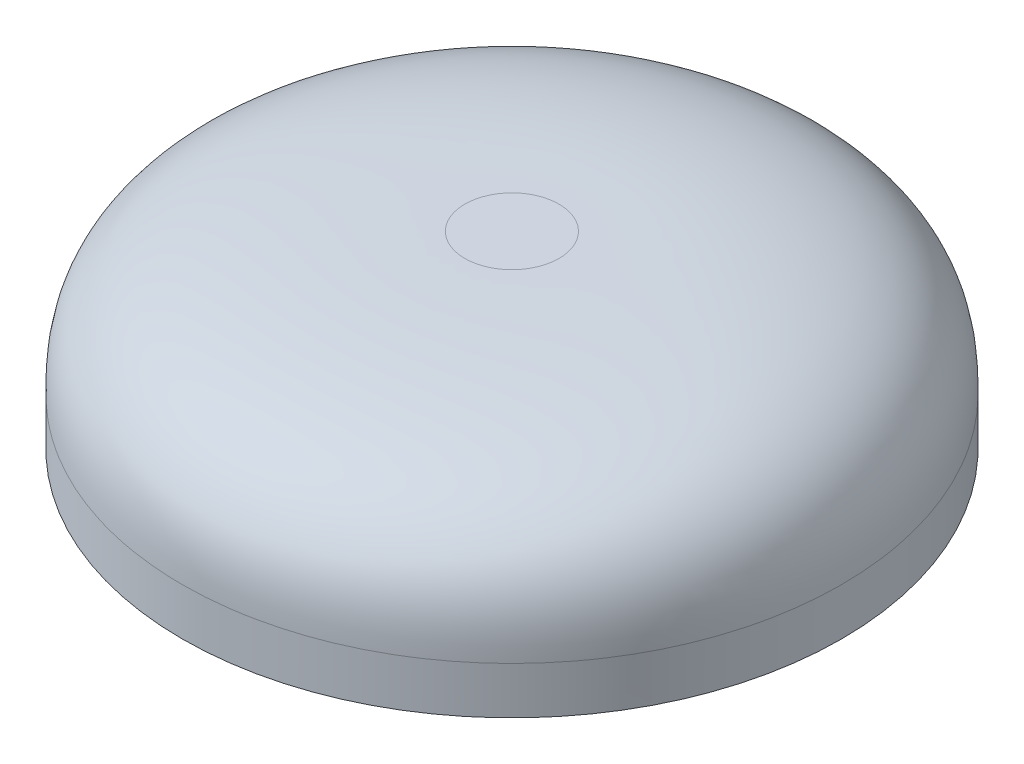
ISO-10303-21;
HEADER;
FILE_DESCRIPTION(('STEP AP214'),'2;1');
FILE_NAME('part.step','',(''),(''),'','','');
FILE_SCHEMA(('AUTOMOTIVE_DESIGN { 1 0 10303 214 1 1 1 1 }'));
ENDSEC;
DATA;
#1=APPLICATION_CONTEXT('core data for automotive mechanical design processes');
#2=APPLICATION_PROTOCOL_DEFINITION('international standard','automotive_design',2000,#1);
#3=PRODUCT_CONTEXT('',#1,'mechanical');
#4=PRODUCT('Part','Part','',(#3));
#5=PRODUCT_RELATED_PRODUCT_CATEGORY('part','',(#4));
#6=PRODUCT_DEFINITION_FORMATION('','',#4);
#7=PRODUCT_DEFINITION_CONTEXT('part definition',#1,'design');
#8=PRODUCT_DEFINITION('design','',#6,#7);
#9=PRODUCT_DEFINITION_SHAPE('','',#8);
#10=(LENGTH_UNIT() NAMED_UNIT(*) SI_UNIT(.MILLI.,.METRE.));
#11=(NAMED_UNIT(*) PLANE_ANGLE_UNIT() SI_UNIT($,.RADIAN.));
#12=(NAMED_UNIT(*) SI_UNIT($,.STERADIAN.) SOLID_ANGLE_UNIT());
#13=UNCERTAINTY_MEASURE_WITH_UNIT(LENGTH_MEASURE(1.E-05),#10,'distance_accuracy_value','');
#14=(GEOMETRIC_REPRESENTATION_CONTEXT(3) GLOBAL_UNCERTAINTY_ASSIGNED_CONTEXT((#13)) GLOBAL_UNIT_ASSIGNED_CONTEXT((#10,
#11,#12)) REPRESENTATION_CONTEXT('',''));
#15=CARTESIAN_POINT('',(0.,0.,0.));
#16=DIRECTION('',(0.,0.,1.));
#17=DIRECTION('',(1.,0.,0.));
#18=AXIS2_PLACEMENT_3D('',#15,#16,#17);
#19=CARTESIAN_POINT('',(0.,10.,0.));
#20=DIRECTION('',(0.,-1.,0.));
#21=DIRECTION('',(0.,0.,-1.));
#22=AXIS2_PLACEMENT_3D('',#19,#20,#21);
#23=CYLINDRICAL_SURFACE('',#22,17.5);
#24=CARTESIAN_POINT('',(0.,2.5,17.5));
#25=CARTESIAN_POINT('',(2.2904363849208,2.5,17.5));
#26=CARTESIAN_POINT('',(6.8713091547624,2.5,16.5888077526858));
#27=CARTESIAN_POINT('',(12.6965237792848,2.5,12.6965237792848));
#28=CARTESIAN_POINT('',(16.5888077526858,2.5,6.87130915476238));
#29=CARTESIAN_POINT('',(17.9555961236571,2.5,0.));
#30=CARTESIAN_POINT('',(16.5888077526858,2.5,-6.87130915476241));
#31=CARTESIAN_POINT('',(12.6965237792848,2.5,-12.6965237792848));
#32=CARTESIAN_POINT('',(6.87130915476245,2.5,-16.5888077526858));
#33=CARTESIAN_POINT('',(0.,2.5,-17.9555961236571));
#34=CARTESIAN_POINT('',(-6.87130915476235,2.5,-16.5888077526858));
#35=CARTESIAN_POINT('',(-12.6965237792849,2.5,-12.6965237792848));
#36=CARTESIAN_POINT('',(-16.5888077526858,2.5,-6.87130915476245));
#37=CARTESIAN_POINT('',(-17.9555961236571,2.5,0.));
#38=CARTESIAN_POINT('',(-16.5888077526858,2.5,6.87130915476235));
#39=CARTESIAN_POINT('',(-12.6965237792849,2.5,12.6965237792848));
#40=CARTESIAN_POINT('',(-6.87130915476242,2.5,16.5888077526858));
#41=CARTESIAN_POINT('',(-2.2904363849208,2.5,17.5));
#42=CARTESIAN_POINT('',(0.,2.5,17.5));
#43=B_SPLINE_CURVE_WITH_KNOTS('',3,(#24,#25,#26,#27,#28,#29,#30,#31,#32,#33,#34,#35,#36,#37,#38,
#39,#40,#41,#42),.UNSPECIFIED.,.T.,.F.,(4,1,1,1,1,1,1,1,1,1,1,1,1,1,1,1,4),(0.,
0.392699081698724,0.785398163397448,1.17809724509617,1.5707963267949,1.96349540849362,
2.35619449019234,2.74889357189107,3.14159265358979,3.53429173528852,3.92699081698724,
4.31968989868597,4.71238898038469,5.10508806208341,5.49778714378214,5.89048622548086,
6.28318530717959),.UNSPECIFIED.);
#44=CARTESIAN_POINT('',(0.,2.5,17.5));
#45=VERTEX_POINT('',#44);
#46=EDGE_CURVE('E11',#45,#45,#43,.F.);
#47=ORIENTED_EDGE('',*,*,#46,.T.);
#48=EDGE_LOOP('',(#47));
#49=FACE_BOUND('',#48,.T.);
#50=CARTESIAN_POINT('',(0.,0.,0.));
#51=DIRECTION('',(0.,1.,0.));
#52=DIRECTION('',(0.,0.,1.));
#53=AXIS2_PLACEMENT_3D('',#50,#51,#52);
#54=CIRCLE('',#53,17.5);
#55=CARTESIAN_POINT('',(0.,0.,17.5));
#56=VERTEX_POINT('',#55);
#57=EDGE_CURVE('E62',#56,#56,#54,.T.);
#58=ORIENTED_EDGE('',*,*,#57,.T.);
#59=EDGE_LOOP('',(#58));
#60=FACE_BOUND('',#59,.T.);
#61=ADVANCED_FACE('F42',(#49,#60),#23,.T.);
#62=CARTESIAN_POINT('',(0.,10.,0.));
#63=DIRECTION('',(0.,1.,0.));
#64=DIRECTION('',(0.,0.,1.));
#65=AXIS2_PLACEMENT_3D('',#62,#63,#64);
#66=PLANE('',#65);
#67=CARTESIAN_POINT('',(0.,10.,2.5));
#68=CARTESIAN_POINT('',(-0.327205197845829,10.,2.5));
#69=CARTESIAN_POINT('',(-0.981615593537489,10.,2.36982967895512));
#70=CARTESIAN_POINT('',(-1.81378911132641,10.,1.8137891113264));
#71=CARTESIAN_POINT('',(-2.36982967895512,10.,0.981615593537479));
#72=CARTESIAN_POINT('',(-2.56508516052245,10.,0.));
#73=CARTESIAN_POINT('',(-2.36982967895511,10.,-0.981615593537494));
#74=CARTESIAN_POINT('',(-1.81378911132641,10.,-1.8137891113264));
#75=CARTESIAN_POINT('',(-0.981615593537479,10.,-2.36982967895512));
#76=CARTESIAN_POINT('',(0.,10.,-2.56508516052244));
#77=CARTESIAN_POINT('',(0.981615593537494,10.,-2.36982967895511));
#78=CARTESIAN_POINT('',(1.8137891113264,9.99999999999999,-1.81378911132641));
#79=CARTESIAN_POINT('',(2.36982967895512,10.,-0.981615593537487));
#80=CARTESIAN_POINT('',(2.56508516052244,10.,0.));
#81=CARTESIAN_POINT('',(2.36982967895512,10.,0.981615593537485));
#82=CARTESIAN_POINT('',(1.81378911132641,10.,1.81378911132641));
#83=CARTESIAN_POINT('',(0.981615593537487,10.,2.36982967895512));
#84=CARTESIAN_POINT('',(0.327205197845829,10.,2.5));
#85=CARTESIAN_POINT('',(0.,10.,2.5));
#86=B_SPLINE_CURVE_WITH_KNOTS('',3,(#67,#68,#69,#70,#71,#72,#73,#74,#75,#76,#77,#78,#79,#80,#81,
#82,#83,#84,#85),.UNSPECIFIED.,.T.,.F.,(4,1,1,1,1,1,1,1,1,1,1,1,1,1,1,1,4),(0.,
0.392699081698724,0.785398163397448,1.17809724509617,1.5707963267949,1.96349540849362,
2.35619449019235,2.74889357189107,3.14159265358979,3.53429173528852,3.92699081698724,
4.31968989868597,4.71238898038469,5.10508806208341,5.49778714378214,5.89048622548086,
6.28318530717959),.UNSPECIFIED.);
#87=CARTESIAN_POINT('',(0.,10.,2.5));
#88=VERTEX_POINT('',#87);
#89=EDGE_CURVE('E56',#88,#88,#86,.F.);
#90=ORIENTED_EDGE('',*,*,#89,.T.);
#91=EDGE_LOOP('',(#90));
#92=FACE_BOUND('',#91,.T.);
#93=ADVANCED_FACE('F76',(#92),#66,.T.);
#94=CARTESIAN_POINT('',(0.,0.,0.));
#95=DIRECTION('',(0.,1.,0.));
#96=DIRECTION('',(0.,0.,1.));
#97=AXIS2_PLACEMENT_3D('',#94,#95,#96);
#98=PLANE('',#97);
#99=ORIENTED_EDGE('',*,*,#57,.F.);
#100=EDGE_LOOP('',(#99));
#101=FACE_BOUND('',#100,.T.);
#102=ADVANCED_FACE('F85',(#101),#98,.F.);
#103=CARTESIAN_POINT('',(0.,10.,2.5));
#104=CARTESIAN_POINT('',(0.327205197845829,10.,2.5));
#105=CARTESIAN_POINT('',(0.981615593537487,10.,2.36982967895512));
#106=CARTESIAN_POINT('',(1.81378911132641,10.,1.81378911132641));
#107=CARTESIAN_POINT('',(2.36982967895512,10.,0.981615593537485));
#108=CARTESIAN_POINT('',(2.56508516052244,10.,0.));
#109=CARTESIAN_POINT('',(2.36982967895512,10.,-0.981615593537487));
#110=CARTESIAN_POINT('',(1.8137891113264,9.99999999999999,-1.81378911132641));
#111=CARTESIAN_POINT('',(0.981615593537494,10.,-2.36982967895511));
#112=CARTESIAN_POINT('',(0.,10.,-2.56508516052244));
#113=CARTESIAN_POINT('',(-0.981615593537479,10.,-2.36982967895512));
#114=CARTESIAN_POINT('',(-1.81378911132641,10.,-1.8137891113264));
#115=CARTESIAN_POINT('',(-2.36982967895511,10.,-0.981615593537494));
#116=CARTESIAN_POINT('',(-2.56508516052245,10.,0.));
#117=CARTESIAN_POINT('',(-2.36982967895512,10.,0.981615593537479));
#118=CARTESIAN_POINT('',(-1.81378911132641,10.,1.8137891113264));
#119=CARTESIAN_POINT('',(-0.981615593537489,10.,2.36982967895512));
#120=CARTESIAN_POINT('',(-0.327205197845829,10.,2.5));
#121=CARTESIAN_POINT('',(0.,10.,2.5));
#122=CARTESIAN_POINT('',(0.,10.,5.0229707730092));
#123=CARTESIAN_POINT('',(0.657416858222516,10.,5.0229707730092));
#124=CARTESIAN_POINT('',(1.97225057466754,10.,4.76143408576051));
#125=CARTESIAN_POINT('',(3.64424387783794,10.,3.64424387783794));
#126=CARTESIAN_POINT('',(4.76143408576052,10.,1.97225057466754));
#127=CARTESIAN_POINT('',(5.15373911663354,10.,0.));
#128=CARTESIAN_POINT('',(4.76143408576052,10.,-1.97225057466755));
#129=CARTESIAN_POINT('',(3.64424387783793,9.99999999999999,-3.64424387783794));
#130=CARTESIAN_POINT('',(1.97225057466756,10.,-4.76143408576051));
#131=CARTESIAN_POINT('',(0.,10.,-5.15373911663354));
#132=CARTESIAN_POINT('',(-1.97225057466753,10.,-4.76143408576053));
#133=CARTESIAN_POINT('',(-3.64424387783795,10.,-3.64424387783793));
#134=CARTESIAN_POINT('',(-4.76143408576051,10.,-1.97225057466756));
#135=CARTESIAN_POINT('',(-5.15373911663354,10.,0.));
#136=CARTESIAN_POINT('',(-4.76143408576052,10.,1.97225057466753));
#137=CARTESIAN_POINT('',(-3.64424387783796,10.,3.64424387783794));
#138=CARTESIAN_POINT('',(-1.97225057466755,10.,4.76143408576052));
#139=CARTESIAN_POINT('',(-0.657416858222515,10.,5.0229707730092));
#140=CARTESIAN_POINT('',(0.,10.,5.0229707730092));
#141=CARTESIAN_POINT('',(0.,10.,7.5459415460184));
#142=CARTESIAN_POINT('',(0.987628518599202,10.,7.5459415460184));
#143=CARTESIAN_POINT('',(2.9628855557976,10.,7.1530384925659));
#144=CARTESIAN_POINT('',(5.47469864434948,10.,5.47469864434948));
#145=CARTESIAN_POINT('',(7.15303849256593,10.,2.9628855557976));
#146=CARTESIAN_POINT('',(7.74239307274463,10.,0.));
#147=CARTESIAN_POINT('',(7.15303849256593,10.,-2.96288555579761));
#148=CARTESIAN_POINT('',(5.47469864434946,9.99999999999999,-5.47469864434948));
#149=CARTESIAN_POINT('',(2.96288555579763,10.,-7.15303849256591));
#150=CARTESIAN_POINT('',(0.,9.99999999999999,-7.74239307274463));
#151=CARTESIAN_POINT('',(-2.96288555579758,10.,-7.15303849256593));
#152=CARTESIAN_POINT('',(-5.47469864434949,10.,-5.47469864434946));
#153=CARTESIAN_POINT('',(-7.15303849256591,10.,-2.96288555579763));
#154=CARTESIAN_POINT('',(-7.74239307274464,10.,0.));
#155=CARTESIAN_POINT('',(-7.15303849256592,10.,2.96288555579758));
#156=CARTESIAN_POINT('',(-5.47469864434951,9.99999999999999,5.47469864434948));
#157=CARTESIAN_POINT('',(-2.96288555579761,10.,7.15303849256592));
#158=CARTESIAN_POINT('',(-0.987628518599202,10.,7.5459415460184));
#159=CARTESIAN_POINT('',(0.,10.,7.5459415460184));
#160=CARTESIAN_POINT('',(0.,9.46231060122937,13.1066017177982));
#161=CARTESIAN_POINT('',(1.71541928326346,9.46231060122938,13.1066017177982));
#162=CARTESIAN_POINT('',(5.14625784979037,9.46231060122938,12.4241654964329));
#163=CARTESIAN_POINT('',(9.50904459289373,9.46231060122937,9.50904459289374));
#164=CARTESIAN_POINT('',(12.4241654964329,9.46231060122938,5.14625784979036));
#165=CARTESIAN_POINT('',(13.4478198284809,9.46231060122937,0.));
#166=CARTESIAN_POINT('',(12.4241654964329,9.46231060122938,-5.14625784979038));
#167=CARTESIAN_POINT('',(9.50904459289371,9.46231060122937,-9.50904459289374));
#168=CARTESIAN_POINT('',(5.14625784979041,9.46231060122938,-12.4241654964329));
#169=CARTESIAN_POINT('',(0.,9.46231060122937,-13.4478198284809));
#170=CARTESIAN_POINT('',(-5.14625784979033,9.46231060122938,-12.4241654964329));
#171=CARTESIAN_POINT('',(-9.50904459289376,9.46231060122937,-9.50904459289372));
#172=CARTESIAN_POINT('',(-12.4241654964329,9.46231060122937,-5.14625784979041));
#173=CARTESIAN_POINT('',(-13.4478198284809,9.46231060122937,0.));
#174=CARTESIAN_POINT('',(-12.4241654964329,9.46231060122938,5.14625784979033));
#175=CARTESIAN_POINT('',(-9.50904459289377,9.46231060122937,9.50904459289371));
#176=CARTESIAN_POINT('',(-5.14625784979038,9.46231060122938,12.4241654964329));
#177=CARTESIAN_POINT('',(-1.71541928326346,9.46231060122938,13.1066017177982));
#178=CARTESIAN_POINT('',(0.,9.46231060122937,13.1066017177982));
#179=CARTESIAN_POINT('',(0.,7.80330085889911,16.4246212024588));
#180=CARTESIAN_POINT('',(2.14968857203733,7.80330085889911,16.4246212024588));
#181=CARTESIAN_POINT('',(6.44906571611198,7.8033008588991,15.5694219164729));
#182=CARTESIAN_POINT('',(11.9163196378722,7.80330085889911,11.9163196378722));
#183=CARTESIAN_POINT('',(15.5694219164729,7.80330085889911,6.44906571611195));
#184=CARTESIAN_POINT('',(16.8522208454517,7.80330085889911,0.));
#185=CARTESIAN_POINT('',(15.5694219164729,7.80330085889911,-6.44906571611198));
#186=CARTESIAN_POINT('',(11.9163196378722,7.8033008588991,-11.9163196378722));
#187=CARTESIAN_POINT('',(6.44906571611202,7.80330085889911,-15.5694219164729));
#188=CARTESIAN_POINT('',(0.,7.8033008588991,-16.8522208454517));
#189=CARTESIAN_POINT('',(-6.44906571611193,7.80330085889911,-15.5694219164729));
#190=CARTESIAN_POINT('',(-11.9163196378722,7.80330085889911,-11.9163196378722));
#191=CARTESIAN_POINT('',(-15.5694219164729,7.8033008588991,-6.44906571611202));
#192=CARTESIAN_POINT('',(-16.8522208454517,7.80330085889911,0.));
#193=CARTESIAN_POINT('',(-15.5694219164729,7.80330085889911,6.44906571611192));
#194=CARTESIAN_POINT('',(-11.9163196378722,7.80330085889912,11.9163196378721));
#195=CARTESIAN_POINT('',(-6.44906571611198,7.8033008588991,15.5694219164729));
#196=CARTESIAN_POINT('',(-2.14968857203733,7.80330085889911,16.4246212024588));
#197=CARTESIAN_POINT('',(0.,7.80330085889911,16.4246212024588));
#198=CARTESIAN_POINT('',(0.,5.0229707730092,17.5));
#199=CARTESIAN_POINT('',(2.2904363849208,5.0229707730092,17.5));
#200=CARTESIAN_POINT('',(6.8713091547624,5.0229707730092,16.5888077526858));
#201=CARTESIAN_POINT('',(12.6965237792848,5.0229707730092,12.6965237792848));
#202=CARTESIAN_POINT('',(16.5888077526858,5.0229707730092,6.87130915476238));
#203=CARTESIAN_POINT('',(17.9555961236571,5.0229707730092,0.));
#204=CARTESIAN_POINT('',(16.5888077526858,5.0229707730092,-6.87130915476241));
#205=CARTESIAN_POINT('',(12.6965237792848,5.0229707730092,-12.6965237792848));
#206=CARTESIAN_POINT('',(6.87130915476245,5.0229707730092,-16.5888077526858));
#207=CARTESIAN_POINT('',(0.,5.0229707730092,-17.9555961236571));
#208=CARTESIAN_POINT('',(-6.87130915476235,5.0229707730092,-16.5888077526858));
#209=CARTESIAN_POINT('',(-12.6965237792849,5.0229707730092,-12.6965237792848));
#210=CARTESIAN_POINT('',(-16.5888077526858,5.0229707730092,-6.87130915476245));
#211=CARTESIAN_POINT('',(-17.9555961236571,5.0229707730092,0.));
#212=CARTESIAN_POINT('',(-16.5888077526858,5.0229707730092,6.87130915476235));
#213=CARTESIAN_POINT('',(-12.6965237792849,5.0229707730092,12.6965237792848));
#214=CARTESIAN_POINT('',(-6.87130915476242,5.0229707730092,16.5888077526858));
#215=CARTESIAN_POINT('',(-2.2904363849208,5.0229707730092,17.5));
#216=CARTESIAN_POINT('',(0.,5.0229707730092,17.5));
#217=CARTESIAN_POINT('',(0.,3.7614853865046,17.5));
#218=CARTESIAN_POINT('',(2.2904363849208,3.7614853865046,17.5));
#219=CARTESIAN_POINT('',(6.8713091547624,3.7614853865046,16.5888077526858));
#220=CARTESIAN_POINT('',(12.6965237792848,3.7614853865046,12.6965237792848));
#221=CARTESIAN_POINT('',(16.5888077526858,3.7614853865046,6.87130915476238));
#222=CARTESIAN_POINT('',(17.9555961236571,3.7614853865046,0.));
#223=CARTESIAN_POINT('',(16.5888077526858,3.7614853865046,-6.87130915476241));
#224=CARTESIAN_POINT('',(12.6965237792848,3.7614853865046,-12.6965237792848));
#225=CARTESIAN_POINT('',(6.87130915476245,3.7614853865046,-16.5888077526858));
#226=CARTESIAN_POINT('',(0.,3.7614853865046,-17.9555961236571));
#227=CARTESIAN_POINT('',(-6.87130915476235,3.7614853865046,-16.5888077526858));
#228=CARTESIAN_POINT('',(-12.6965237792849,3.7614853865046,-12.6965237792848));
#229=CARTESIAN_POINT('',(-16.5888077526858,3.7614853865046,-6.87130915476245));
#230=CARTESIAN_POINT('',(-17.9555961236571,3.7614853865046,0.));
#231=CARTESIAN_POINT('',(-16.5888077526858,3.7614853865046,6.87130915476235));
#232=CARTESIAN_POINT('',(-12.6965237792849,3.7614853865046,12.6965237792848));
#233=CARTESIAN_POINT('',(-6.87130915476242,3.7614853865046,16.5888077526858));
#234=CARTESIAN_POINT('',(-2.2904363849208,3.7614853865046,17.5));
#235=CARTESIAN_POINT('',(0.,3.7614853865046,17.5));
#236=CARTESIAN_POINT('',(0.,2.5,17.5));
#237=CARTESIAN_POINT('',(2.2904363849208,2.5,17.5));
#238=CARTESIAN_POINT('',(6.8713091547624,2.5,16.5888077526858));
#239=CARTESIAN_POINT('',(12.6965237792848,2.5,12.6965237792848));
#240=CARTESIAN_POINT('',(16.5888077526858,2.5,6.87130915476238));
#241=CARTESIAN_POINT('',(17.9555961236571,2.5,0.));
#242=CARTESIAN_POINT('',(16.5888077526858,2.5,-6.87130915476241));
#243=CARTESIAN_POINT('',(12.6965237792848,2.5,-12.6965237792848));
#244=CARTESIAN_POINT('',(6.87130915476245,2.5,-16.5888077526858));
#245=CARTESIAN_POINT('',(0.,2.5,-17.9555961236571));
#246=CARTESIAN_POINT('',(-6.87130915476235,2.5,-16.5888077526858));
#247=CARTESIAN_POINT('',(-12.6965237792849,2.5,-12.6965237792848));
#248=CARTESIAN_POINT('',(-16.5888077526858,2.5,-6.87130915476245));
#249=CARTESIAN_POINT('',(-17.9555961236571,2.5,0.));
#250=CARTESIAN_POINT('',(-16.5888077526858,2.5,6.87130915476235));
#251=CARTESIAN_POINT('',(-12.6965237792849,2.5,12.6965237792848));
#252=CARTESIAN_POINT('',(-6.87130915476242,2.5,16.5888077526858));
#253=CARTESIAN_POINT('',(-2.2904363849208,2.5,17.5));
#254=CARTESIAN_POINT('',(0.,2.5,17.5));
#255=B_SPLINE_SURFACE_WITH_KNOTS('',5,3,((#103,#104,#105,#106,#107,#108,#109,#110,#111,#112,
#113,#114,#115,#116,#117,#118,#119,#120,#121),(#122,#123,#124,#125,#126,#127,#128,#129,#130,
#131,#132,#133,#134,#135,#136,#137,#138,#139,#140),(#141,#142,#143,#144,#145,#146,#147,#148,
#149,#150,#151,#152,#153,#154,#155,#156,#157,#158,#159),(#160,#161,#162,#163,#164,#165,#166,
#167,#168,#169,#170,#171,#172,#173,#174,#175,#176,#177,#178),(#179,#180,#181,#182,#183,#184,
#185,#186,#187,#188,#189,#190,#191,#192,#193,#194,#195,#196,#197),(#198,#199,#200,#201,#202,
#203,#204,#205,#206,#207,#208,#209,#210,#211,#212,#213,#214,#215,#216),(#217,#218,#219,#220,
#221,#222,#223,#224,#225,#226,#227,#228,#229,#230,#231,#232,#233,#234,#235),(#236,#237,#238,
#239,#240,#241,#242,#243,#244,#245,#246,#247,#248,#249,#250,#251,#252,#253,#254)),.UNSPECIFIED.,
.F.,.T.,.F.,(6,2,6),(4,1,1,1,1,1,1,1,1,1,1,1,1,1,1,1,4),(0.,0.5,1.),(0.,0.392699081698724,
0.785398163397448,1.17809724509617,1.5707963267949,1.96349540849362,2.35619449019234,
2.74889357189107,3.14159265358979,3.53429173528852,3.92699081698724,4.31968989868597,
4.71238898038469,5.10508806208341,5.49778714378214,5.89048622548086,6.28318530717959),.UNSPECIFIED.);
#256=ORIENTED_EDGE('',*,*,#46,.F.);
#257=EDGE_LOOP('',(#256));
#258=FACE_BOUND('',#257,.T.);
#259=ORIENTED_EDGE('',*,*,#89,.F.);
#260=EDGE_LOOP('',(#259));
#261=FACE_BOUND('',#260,.T.);
#262=ADVANCED_FACE('F45',(#258,#261),#255,.T.);
#263=CLOSED_SHELL('',(#61,#93,#102,#262));
#264=MANIFOLD_SOLID_BREP('B2',#263);
#265=ADVANCED_BREP_SHAPE_REPRESENTATION('',(#18,#264),#14);
#266=SHAPE_DEFINITION_REPRESENTATION(#9,#265);
ENDSEC;
END-ISO-10303-21;
